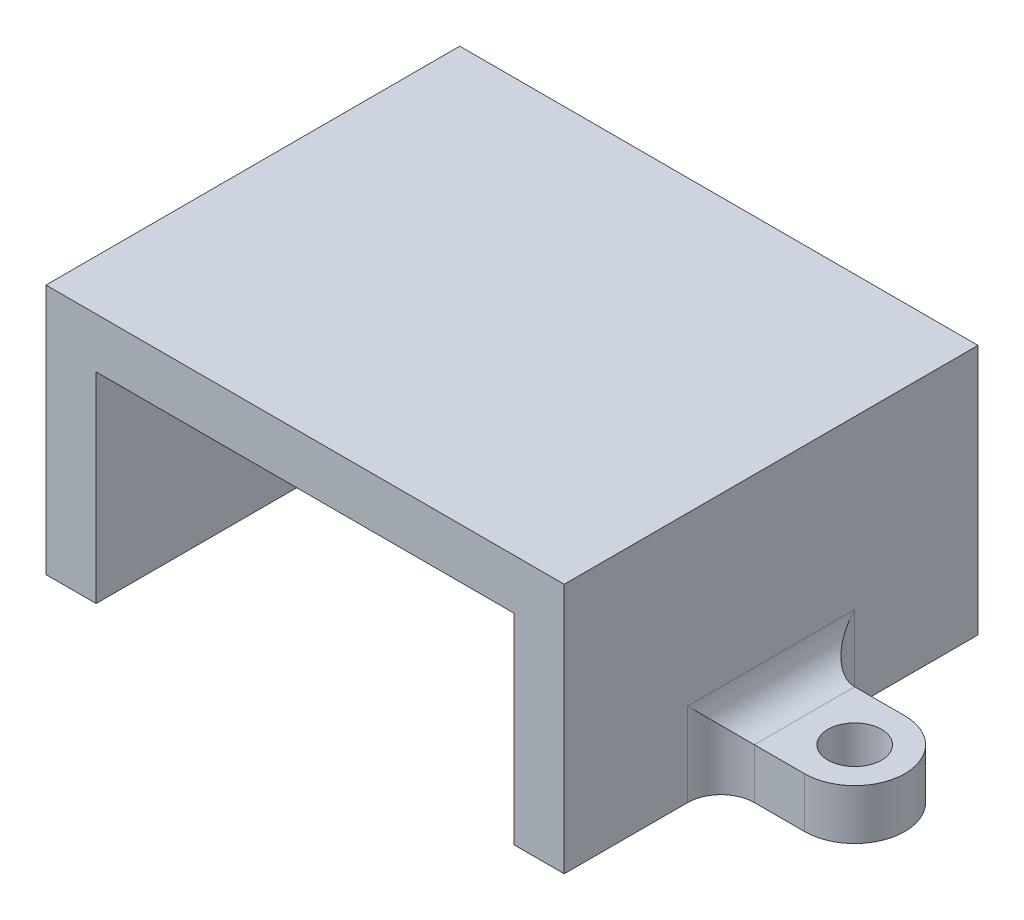
ISO-10303-21;
HEADER;
FILE_DESCRIPTION(('STEP AP214'),'2;1');
FILE_NAME('part.step','',(''),(''),'','','');
FILE_SCHEMA(('AUTOMOTIVE_DESIGN { 1 0 10303 214 1 1 1 1 }'));
ENDSEC;
DATA;
#1=APPLICATION_CONTEXT('core data for automotive mechanical design processes');
#2=APPLICATION_PROTOCOL_DEFINITION('international standard','automotive_design',2000,#1);
#3=PRODUCT_CONTEXT('',#1,'mechanical');
#4=PRODUCT('Part','Part','',(#3));
#5=PRODUCT_RELATED_PRODUCT_CATEGORY('part','',(#4));
#6=PRODUCT_DEFINITION_FORMATION('','',#4);
#7=PRODUCT_DEFINITION_CONTEXT('part definition',#1,'design');
#8=PRODUCT_DEFINITION('design','',#6,#7);
#9=PRODUCT_DEFINITION_SHAPE('','',#8);
#10=(LENGTH_UNIT() NAMED_UNIT(*) SI_UNIT(.MILLI.,.METRE.));
#11=(NAMED_UNIT(*) PLANE_ANGLE_UNIT() SI_UNIT($,.RADIAN.));
#12=(NAMED_UNIT(*) SI_UNIT($,.STERADIAN.) SOLID_ANGLE_UNIT());
#13=UNCERTAINTY_MEASURE_WITH_UNIT(LENGTH_MEASURE(1.E-05),#10,'distance_accuracy_value','');
#14=(GEOMETRIC_REPRESENTATION_CONTEXT(3) GLOBAL_UNCERTAINTY_ASSIGNED_CONTEXT((#13)) GLOBAL_UNIT_ASSIGNED_CONTEXT((#10,
#11,#12)) REPRESENTATION_CONTEXT('',''));
#15=CARTESIAN_POINT('',(0.,0.,0.));
#16=DIRECTION('',(0.,0.,1.));
#17=DIRECTION('',(1.,0.,0.));
#18=AXIS2_PLACEMENT_3D('',#15,#16,#17);
#19=CARTESIAN_POINT('',(31.,0.,24.75));
#20=DIRECTION('',(-1.,0.,0.));
#21=DIRECTION('',(0.,0.,1.));
#22=AXIS2_PLACEMENT_3D('',#19,#20,#21);
#23=PLANE('',#22);
#24=DIRECTION('',(0.,0.,-1.));
#25=VECTOR('',#24,1.);
#26=CARTESIAN_POINT('',(31.,5.,9.375));
#27=LINE('',#26,#25);
#28=CARTESIAN_POINT('',(31.,5.,17.375));
#29=VERTEX_POINT('',#28);
#30=CARTESIAN_POINT('',(31.,5.,7.375));
#31=VERTEX_POINT('',#30);
#32=EDGE_CURVE('E345',#29,#31,#27,.T.);
#33=ORIENTED_EDGE('',*,*,#32,.T.);
#34=DIRECTION('',(0.,-1.,0.));
#35=VECTOR('',#34,1.);
#36=CARTESIAN_POINT('',(31.,0.,7.375));
#37=LINE('',#36,#35);
#38=CARTESIAN_POINT('',(31.,0.,7.375));
#39=VERTEX_POINT('',#38);
#40=EDGE_CURVE('E351',#31,#39,#37,.T.);
#41=ORIENTED_EDGE('',*,*,#40,.T.);
#42=DIRECTION('',(0.,0.,-1.));
#43=VECTOR('',#42,1.);
#44=CARTESIAN_POINT('',(31.,0.,24.75));
#45=LINE('',#44,#43);
#46=CARTESIAN_POINT('',(31.,0.,0.));
#47=VERTEX_POINT('',#46);
#48=EDGE_CURVE('E320',#39,#47,#45,.T.);
#49=ORIENTED_EDGE('',*,*,#48,.T.);
#50=DIRECTION('',(0.,1.,0.));
#51=VECTOR('',#50,1.);
#52=CARTESIAN_POINT('',(31.,0.,0.));
#53=LINE('',#52,#51);
#54=CARTESIAN_POINT('',(31.,15.,0.));
#55=VERTEX_POINT('',#54);
#56=EDGE_CURVE('E308',#47,#55,#53,.T.);
#57=ORIENTED_EDGE('',*,*,#56,.T.);
#58=DIRECTION('',(0.,0.,-1.));
#59=VECTOR('',#58,1.);
#60=CARTESIAN_POINT('',(31.,15.,24.75));
#61=LINE('',#60,#59);
#62=CARTESIAN_POINT('',(31.,15.,24.75));
#63=VERTEX_POINT('',#62);
#64=EDGE_CURVE('E316',#63,#55,#61,.T.);
#65=ORIENTED_EDGE('',*,*,#64,.F.);
#66=DIRECTION('',(0.,1.,0.));
#67=VECTOR('',#66,1.);
#68=CARTESIAN_POINT('',(31.,0.,24.75));
#69=LINE('',#68,#67);
#70=CARTESIAN_POINT('',(31.,0.,24.75));
#71=VERTEX_POINT('',#70);
#72=EDGE_CURVE('E282',#71,#63,#69,.T.);
#73=ORIENTED_EDGE('',*,*,#72,.F.);
#74=CARTESIAN_POINT('',(31.,0.,17.375));
#75=VERTEX_POINT('',#74);
#76=EDGE_CURVE('E321',#71,#75,#45,.T.);
#77=ORIENTED_EDGE('',*,*,#76,.T.);
#78=DIRECTION('',(0.,-1.,0.));
#79=VECTOR('',#78,1.);
#80=CARTESIAN_POINT('',(31.,0.,17.375));
#81=LINE('',#80,#79);
#82=EDGE_CURVE('E348',#75,#29,#81,.F.);
#83=ORIENTED_EDGE('',*,*,#82,.T.);
#84=EDGE_LOOP('',(#33,#41,#49,#57,#65,#73,#77,#83));
#85=FACE_BOUND('',#84,.T.);
#86=ADVANCED_FACE('F39',(#85),#23,.F.);
#87=CARTESIAN_POINT('',(0.,15.,24.75));
#88=DIRECTION('',(1.,0.,0.));
#89=DIRECTION('',(0.,0.,-1.));
#90=AXIS2_PLACEMENT_3D('',#87,#88,#89);
#91=PLANE('',#90);
#92=DIRECTION('',(0.,0.,-1.));
#93=VECTOR('',#92,1.);
#94=CARTESIAN_POINT('',(0.,0.,24.75));
#95=LINE('',#94,#93);
#96=CARTESIAN_POINT('',(0.,0.,7.375));
#97=VERTEX_POINT('',#96);
#98=CARTESIAN_POINT('',(0.,0.,0.));
#99=VERTEX_POINT('',#98);
#100=EDGE_CURVE('E341',#97,#99,#95,.T.);
#101=ORIENTED_EDGE('',*,*,#100,.F.);
#102=DIRECTION('',(0.,-1.,0.));
#103=VECTOR('',#102,1.);
#104=CARTESIAN_POINT('',(0.,15.,7.375));
#105=LINE('',#104,#103);
#106=CARTESIAN_POINT('',(0.,5.,7.375));
#107=VERTEX_POINT('',#106);
#108=EDGE_CURVE('E387',#97,#107,#105,.F.);
#109=ORIENTED_EDGE('',*,*,#108,.T.);
#110=DIRECTION('',(0.,0.,1.));
#111=VECTOR('',#110,1.);
#112=CARTESIAN_POINT('',(0.,5.,24.75));
#113=LINE('',#112,#111);
#114=CARTESIAN_POINT('',(0.,5.,17.375));
#115=VERTEX_POINT('',#114);
#116=EDGE_CURVE('E384',#107,#115,#113,.T.);
#117=ORIENTED_EDGE('',*,*,#116,.T.);
#118=DIRECTION('',(0.,-1.,0.));
#119=VECTOR('',#118,1.);
#120=CARTESIAN_POINT('',(0.,15.,17.375));
#121=LINE('',#120,#119);
#122=CARTESIAN_POINT('',(0.,0.,17.375));
#123=VERTEX_POINT('',#122);
#124=EDGE_CURVE('E381',#115,#123,#121,.T.);
#125=ORIENTED_EDGE('',*,*,#124,.T.);
#126=CARTESIAN_POINT('',(0.,0.,24.75));
#127=VERTEX_POINT('',#126);
#128=EDGE_CURVE('E342',#127,#123,#95,.T.);
#129=ORIENTED_EDGE('',*,*,#128,.F.);
#130=DIRECTION('',(0.,-1.,0.));
#131=VECTOR('',#130,1.);
#132=CARTESIAN_POINT('',(0.,15.,24.75));
#133=LINE('',#132,#131);
#134=CARTESIAN_POINT('',(0.,15.,24.75));
#135=VERTEX_POINT('',#134);
#136=EDGE_CURVE('E262',#135,#127,#133,.T.);
#137=ORIENTED_EDGE('',*,*,#136,.F.);
#138=DIRECTION('',(0.,0.,-1.));
#139=VECTOR('',#138,1.);
#140=CARTESIAN_POINT('',(0.,15.,24.75));
#141=LINE('',#140,#139);
#142=CARTESIAN_POINT('',(0.,15.,0.));
#143=VERTEX_POINT('',#142);
#144=EDGE_CURVE('E288',#135,#143,#141,.T.);
#145=ORIENTED_EDGE('',*,*,#144,.T.);
#146=DIRECTION('',(0.,-1.,0.));
#147=VECTOR('',#146,1.);
#148=CARTESIAN_POINT('',(0.,15.,0.));
#149=LINE('',#148,#147);
#150=EDGE_CURVE('E258',#143,#99,#149,.T.);
#151=ORIENTED_EDGE('',*,*,#150,.T.);
#152=EDGE_LOOP('',(#101,#109,#117,#125,#129,#137,#145,#151));
#153=FACE_BOUND('',#152,.T.);
#154=ADVANCED_FACE('F415',(#153),#91,.F.);
#155=CARTESIAN_POINT('',(0.,0.,24.75));
#156=DIRECTION('',(0.,1.,0.));
#157=DIRECTION('',(0.,0.,1.));
#158=AXIS2_PLACEMENT_3D('',#155,#156,#157);
#159=PLANE('',#158);
#160=DIRECTION('',(1.,0.,0.));
#161=VECTOR('',#160,1.);
#162=CARTESIAN_POINT('',(0.,0.,0.));
#163=LINE('',#162,#161);
#164=CARTESIAN_POINT('',(3.,0.,0.));
#165=VERTEX_POINT('',#164);
#166=EDGE_CURVE('E292',#99,#165,#163,.T.);
#167=ORIENTED_EDGE('',*,*,#166,.T.);
#168=DIRECTION('',(0.,0.,-1.));
#169=VECTOR('',#168,1.);
#170=CARTESIAN_POINT('',(3.,0.,24.75));
#171=LINE('',#170,#169);
#172=CARTESIAN_POINT('',(3.,0.,24.75));
#173=VERTEX_POINT('',#172);
#174=EDGE_CURVE('E337',#173,#165,#171,.T.);
#175=ORIENTED_EDGE('',*,*,#174,.F.);
#176=DIRECTION('',(1.,0.,0.));
#177=VECTOR('',#176,1.);
#178=CARTESIAN_POINT('',(0.,0.,24.75));
#179=LINE('',#178,#177);
#180=EDGE_CURVE('E266',#127,#173,#179,.T.);
#181=ORIENTED_EDGE('',*,*,#180,.F.);
#182=ORIENTED_EDGE('',*,*,#128,.T.);
#183=CARTESIAN_POINT('',(-2.,0.,17.375));
#184=DIRECTION('',(0.,1.,0.));
#185=DIRECTION('',(0.,0.,1.));
#186=AXIS2_PLACEMENT_3D('',#183,#184,#185);
#187=CIRCLE('',#186,2.);
#188=CARTESIAN_POINT('',(-2.,0.,15.375));
#189=VERTEX_POINT('',#188);
#190=EDGE_CURVE('E11',#123,#189,#187,.T.);
#191=ORIENTED_EDGE('',*,*,#190,.T.);
#192=DIRECTION('',(-1.,0.,0.));
#193=VECTOR('',#192,1.);
#194=CARTESIAN_POINT('',(0.,0.,15.375));
#195=LINE('',#194,#193);
#196=CARTESIAN_POINT('',(-5.,0.,15.375));
#197=VERTEX_POINT('',#196);
#198=EDGE_CURVE('E229',#189,#197,#195,.T.);
#199=ORIENTED_EDGE('',*,*,#198,.T.);
#200=CARTESIAN_POINT('',(-5.,0.,12.375));
#201=DIRECTION('',(0.,-1.,0.));
#202=DIRECTION('',(0.,0.,1.));
#203=AXIS2_PLACEMENT_3D('',#200,#201,#202);
#204=CIRCLE('',#203,3.);
#205=CARTESIAN_POINT('',(-4.99999999999999,0.,9.375));
#206=VERTEX_POINT('',#205);
#207=EDGE_CURVE('E248',#197,#206,#204,.T.);
#208=ORIENTED_EDGE('',*,*,#207,.T.);
#209=DIRECTION('',(1.,0.,0.));
#210=VECTOR('',#209,1.);
#211=CARTESIAN_POINT('',(-4.99999999999999,0.,9.375));
#212=LINE('',#211,#210);
#213=CARTESIAN_POINT('',(-2.,0.,9.375));
#214=VERTEX_POINT('',#213);
#215=EDGE_CURVE('E237',#206,#214,#212,.T.);
#216=ORIENTED_EDGE('',*,*,#215,.T.);
#217=CARTESIAN_POINT('',(-2.,0.,7.375));
#218=DIRECTION('',(0.,1.,0.));
#219=DIRECTION('',(0.,0.,1.));
#220=AXIS2_PLACEMENT_3D('',#217,#218,#219);
#221=CIRCLE('',#220,2.);
#222=EDGE_CURVE('E49',#214,#97,#221,.T.);
#223=ORIENTED_EDGE('',*,*,#222,.T.);
#224=ORIENTED_EDGE('',*,*,#100,.T.);
#225=EDGE_LOOP('',(#167,#175,#181,#182,#191,#199,#208,#216,#223,#224));
#226=FACE_BOUND('',#225,.T.);
#227=CARTESIAN_POINT('',(-5.,0.,12.375));
#228=DIRECTION('',(0.,-1.,0.));
#229=DIRECTION('',(0.,0.,1.));
#230=AXIS2_PLACEMENT_3D('',#227,#228,#229);
#231=CIRCLE('',#230,1.6);
#232=CARTESIAN_POINT('',(-5.,0.,13.975));
#233=VERTEX_POINT('',#232);
#234=EDGE_CURVE('E223',#233,#233,#231,.T.);
#235=ORIENTED_EDGE('',*,*,#234,.F.);
#236=EDGE_LOOP('',(#235));
#237=FACE_BOUND('',#236,.T.);
#238=ADVANCED_FACE('F417',(#226,#237),#159,.F.);
#239=CARTESIAN_POINT('',(3.,0.,24.75));
#240=DIRECTION('',(-1.,0.,0.));
#241=DIRECTION('',(0.,-1.,0.));
#242=AXIS2_PLACEMENT_3D('',#239,#240,#241);
#243=PLANE('',#242);
#244=DIRECTION('',(0.,1.,0.));
#245=VECTOR('',#244,1.);
#246=CARTESIAN_POINT('',(3.,0.,0.));
#247=LINE('',#246,#245);
#248=CARTESIAN_POINT('',(3.,12.,0.));
#249=VERTEX_POINT('',#248);
#250=EDGE_CURVE('E295',#165,#249,#247,.T.);
#251=ORIENTED_EDGE('',*,*,#250,.T.);
#252=DIRECTION('',(0.,0.,-1.));
#253=VECTOR('',#252,1.);
#254=CARTESIAN_POINT('',(3.,12.,24.75));
#255=LINE('',#254,#253);
#256=CARTESIAN_POINT('',(3.,12.,24.75));
#257=VERTEX_POINT('',#256);
#258=EDGE_CURVE('E333',#257,#249,#255,.T.);
#259=ORIENTED_EDGE('',*,*,#258,.F.);
#260=DIRECTION('',(0.,1.,0.));
#261=VECTOR('',#260,1.);
#262=CARTESIAN_POINT('',(3.,0.,24.75));
#263=LINE('',#262,#261);
#264=EDGE_CURVE('E270',#173,#257,#263,.T.);
#265=ORIENTED_EDGE('',*,*,#264,.F.);
#266=ORIENTED_EDGE('',*,*,#174,.T.);
#267=EDGE_LOOP('',(#251,#259,#265,#266));
#268=FACE_BOUND('',#267,.T.);
#269=ADVANCED_FACE('F435',(#268),#243,.F.);
#270=CARTESIAN_POINT('',(3.,12.,24.75));
#271=DIRECTION('',(0.,1.,0.));
#272=DIRECTION('',(0.,0.,1.));
#273=AXIS2_PLACEMENT_3D('',#270,#271,#272);
#274=PLANE('',#273);
#275=DIRECTION('',(1.,0.,0.));
#276=VECTOR('',#275,1.);
#277=CARTESIAN_POINT('',(3.,12.,0.));
#278=LINE('',#277,#276);
#279=CARTESIAN_POINT('',(28.,12.,0.));
#280=VERTEX_POINT('',#279);
#281=EDGE_CURVE('E298',#249,#280,#278,.T.);
#282=ORIENTED_EDGE('',*,*,#281,.T.);
#283=DIRECTION('',(0.,0.,-1.));
#284=VECTOR('',#283,1.);
#285=CARTESIAN_POINT('',(28.,12.,24.75));
#286=LINE('',#285,#284);
#287=CARTESIAN_POINT('',(28.,12.,24.75));
#288=VERTEX_POINT('',#287);
#289=EDGE_CURVE('E329',#288,#280,#286,.T.);
#290=ORIENTED_EDGE('',*,*,#289,.F.);
#291=DIRECTION('',(1.,0.,0.));
#292=VECTOR('',#291,1.);
#293=CARTESIAN_POINT('',(3.,12.,24.75));
#294=LINE('',#293,#292);
#295=EDGE_CURVE('E273',#257,#288,#294,.T.);
#296=ORIENTED_EDGE('',*,*,#295,.F.);
#297=ORIENTED_EDGE('',*,*,#258,.T.);
#298=EDGE_LOOP('',(#282,#290,#296,#297));
#299=FACE_BOUND('',#298,.T.);
#300=ADVANCED_FACE('F442',(#299),#274,.F.);
#301=CARTESIAN_POINT('',(28.,12.,24.75));
#302=DIRECTION('',(1.,0.,0.));
#303=DIRECTION('',(0.,0.,-1.));
#304=AXIS2_PLACEMENT_3D('',#301,#302,#303);
#305=PLANE('',#304);
#306=DIRECTION('',(0.,-1.,0.));
#307=VECTOR('',#306,1.);
#308=CARTESIAN_POINT('',(28.,12.,0.));
#309=LINE('',#308,#307);
#310=CARTESIAN_POINT('',(28.,0.,0.));
#311=VERTEX_POINT('',#310);
#312=EDGE_CURVE('E301',#280,#311,#309,.T.);
#313=ORIENTED_EDGE('',*,*,#312,.T.);
#314=DIRECTION('',(0.,0.,-1.));
#315=VECTOR('',#314,1.);
#316=CARTESIAN_POINT('',(28.,0.,24.75));
#317=LINE('',#316,#315);
#318=CARTESIAN_POINT('',(28.,0.,24.75));
#319=VERTEX_POINT('',#318);
#320=EDGE_CURVE('E325',#319,#311,#317,.T.);
#321=ORIENTED_EDGE('',*,*,#320,.F.);
#322=DIRECTION('',(0.,-1.,0.));
#323=VECTOR('',#322,1.);
#324=CARTESIAN_POINT('',(28.,12.,24.75));
#325=LINE('',#324,#323);
#326=EDGE_CURVE('E276',#288,#319,#325,.T.);
#327=ORIENTED_EDGE('',*,*,#326,.F.);
#328=ORIENTED_EDGE('',*,*,#289,.T.);
#329=EDGE_LOOP('',(#313,#321,#327,#328));
#330=FACE_BOUND('',#329,.T.);
#331=ADVANCED_FACE('F445',(#330),#305,.F.);
#332=CARTESIAN_POINT('',(28.,0.,24.75));
#333=DIRECTION('',(0.,1.,0.));
#334=DIRECTION('',(0.,0.,1.));
#335=AXIS2_PLACEMENT_3D('',#332,#333,#334);
#336=PLANE('',#335);
#337=DIRECTION('',(1.,0.,0.));
#338=VECTOR('',#337,1.);
#339=CARTESIAN_POINT('',(28.,0.,0.));
#340=LINE('',#339,#338);
#341=EDGE_CURVE('E304',#311,#47,#340,.T.);
#342=ORIENTED_EDGE('',*,*,#341,.T.);
#343=ORIENTED_EDGE('',*,*,#48,.F.);
#344=CARTESIAN_POINT('',(33.,0.,7.375));
#345=DIRECTION('',(0.,1.,0.));
#346=DIRECTION('',(0.,0.,1.));
#347=AXIS2_PLACEMENT_3D('',#344,#345,#346);
#348=CIRCLE('',#347,2.);
#349=CARTESIAN_POINT('',(33.,0.,9.375));
#350=VERTEX_POINT('',#349);
#351=EDGE_CURVE('E363',#39,#350,#348,.T.);
#352=ORIENTED_EDGE('',*,*,#351,.T.);
#353=DIRECTION('',(1.,0.,0.));
#354=VECTOR('',#353,1.);
#355=CARTESIAN_POINT('',(36.,0.,9.375));
#356=LINE('',#355,#354);
#357=CARTESIAN_POINT('',(36.,0.,9.375));
#358=VERTEX_POINT('',#357);
#359=EDGE_CURVE('E206',#350,#358,#356,.T.);
#360=ORIENTED_EDGE('',*,*,#359,.T.);
#361=CARTESIAN_POINT('',(36.,0.,12.375));
#362=DIRECTION('',(0.,-1.,0.));
#363=DIRECTION('',(0.,0.,-1.));
#364=AXIS2_PLACEMENT_3D('',#361,#362,#363);
#365=CIRCLE('',#364,3.);
#366=CARTESIAN_POINT('',(36.,0.,15.375));
#367=VERTEX_POINT('',#366);
#368=EDGE_CURVE('E216',#358,#367,#365,.T.);
#369=ORIENTED_EDGE('',*,*,#368,.T.);
#370=DIRECTION('',(-1.,0.,0.));
#371=VECTOR('',#370,1.);
#372=CARTESIAN_POINT('',(31.,0.,15.375));
#373=LINE('',#372,#371);
#374=CARTESIAN_POINT('',(33.,0.,15.375));
#375=VERTEX_POINT('',#374);
#376=EDGE_CURVE('E184',#367,#375,#373,.T.);
#377=ORIENTED_EDGE('',*,*,#376,.T.);
#378=CARTESIAN_POINT('',(33.,0.,17.375));
#379=DIRECTION('',(0.,1.,0.));
#380=DIRECTION('',(0.,0.,1.));
#381=AXIS2_PLACEMENT_3D('',#378,#379,#380);
#382=CIRCLE('',#381,2.);
#383=EDGE_CURVE('E366',#375,#75,#382,.T.);
#384=ORIENTED_EDGE('',*,*,#383,.T.);
#385=ORIENTED_EDGE('',*,*,#76,.F.);
#386=DIRECTION('',(1.,0.,0.));
#387=VECTOR('',#386,1.);
#388=CARTESIAN_POINT('',(28.,0.,24.75));
#389=LINE('',#388,#387);
#390=EDGE_CURVE('E279',#319,#71,#389,.T.);
#391=ORIENTED_EDGE('',*,*,#390,.F.);
#392=ORIENTED_EDGE('',*,*,#320,.T.);
#393=EDGE_LOOP('',(#342,#343,#352,#360,#369,#377,#384,#385,#391,#392));
#394=FACE_BOUND('',#393,.T.);
#395=CARTESIAN_POINT('',(36.,0.,12.375));
#396=DIRECTION('',(0.,-1.,0.));
#397=DIRECTION('',(0.,0.,-1.));
#398=AXIS2_PLACEMENT_3D('',#395,#396,#397);
#399=CIRCLE('',#398,1.6);
#400=CARTESIAN_POINT('',(36.,0.,10.775));
#401=VERTEX_POINT('',#400);
#402=EDGE_CURVE('E211',#401,#401,#399,.T.);
#403=ORIENTED_EDGE('',*,*,#402,.F.);
#404=EDGE_LOOP('',(#403));
#405=FACE_BOUND('',#404,.T.);
#406=ADVANCED_FACE('F450',(#394,#405),#336,.F.);
#407=CARTESIAN_POINT('',(31.,15.,24.75));
#408=DIRECTION('',(0.,-1.,0.));
#409=DIRECTION('',(1.,0.,0.));
#410=AXIS2_PLACEMENT_3D('',#407,#408,#409);
#411=PLANE('',#410);
#412=DIRECTION('',(-1.,0.,0.));
#413=VECTOR('',#412,1.);
#414=CARTESIAN_POINT('',(31.,15.,0.));
#415=LINE('',#414,#413);
#416=EDGE_CURVE('E267',#55,#143,#415,.T.);
#417=ORIENTED_EDGE('',*,*,#416,.T.);
#418=ORIENTED_EDGE('',*,*,#144,.F.);
#419=DIRECTION('',(-1.,0.,0.));
#420=VECTOR('',#419,1.);
#421=CARTESIAN_POINT('',(31.,15.,24.75));
#422=LINE('',#421,#420);
#423=EDGE_CURVE('E285',#63,#135,#422,.T.);
#424=ORIENTED_EDGE('',*,*,#423,.F.);
#425=ORIENTED_EDGE('',*,*,#64,.T.);
#426=EDGE_LOOP('',(#417,#418,#424,#425));
#427=FACE_BOUND('',#426,.T.);
#428=ADVANCED_FACE('F455',(#427),#411,.F.);
#429=CARTESIAN_POINT('',(0.,0.,24.75));
#430=DIRECTION('',(0.,0.,1.));
#431=DIRECTION('',(1.,0.,0.));
#432=AXIS2_PLACEMENT_3D('',#429,#430,#431);
#433=PLANE('',#432);
#434=ORIENTED_EDGE('',*,*,#136,.T.);
#435=ORIENTED_EDGE('',*,*,#180,.T.);
#436=ORIENTED_EDGE('',*,*,#264,.T.);
#437=ORIENTED_EDGE('',*,*,#295,.T.);
#438=ORIENTED_EDGE('',*,*,#326,.T.);
#439=ORIENTED_EDGE('',*,*,#390,.T.);
#440=ORIENTED_EDGE('',*,*,#72,.T.);
#441=ORIENTED_EDGE('',*,*,#423,.T.);
#442=EDGE_LOOP('',(#434,#435,#436,#437,#438,#439,#440,#441));
#443=FACE_BOUND('',#442,.T.);
#444=ADVANCED_FACE('F422',(#443),#433,.T.);
#445=CARTESIAN_POINT('',(0.,0.,0.));
#446=DIRECTION('',(0.,0.,1.));
#447=DIRECTION('',(1.,0.,0.));
#448=AXIS2_PLACEMENT_3D('',#445,#446,#447);
#449=PLANE('',#448);
#450=ORIENTED_EDGE('',*,*,#150,.F.);
#451=ORIENTED_EDGE('',*,*,#416,.F.);
#452=ORIENTED_EDGE('',*,*,#56,.F.);
#453=ORIENTED_EDGE('',*,*,#341,.F.);
#454=ORIENTED_EDGE('',*,*,#312,.F.);
#455=ORIENTED_EDGE('',*,*,#281,.F.);
#456=ORIENTED_EDGE('',*,*,#250,.F.);
#457=ORIENTED_EDGE('',*,*,#166,.F.);
#458=EDGE_LOOP('',(#450,#451,#452,#453,#454,#455,#456,#457));
#459=FACE_BOUND('',#458,.T.);
#460=ADVANCED_FACE('F430',(#459),#449,.F.);
#461=CARTESIAN_POINT('',(0.,3.,15.375));
#462=DIRECTION('',(0.,0.,1.));
#463=DIRECTION('',(1.,0.,0.));
#464=AXIS2_PLACEMENT_3D('',#461,#462,#463);
#465=PLANE('',#464);
#466=ORIENTED_EDGE('',*,*,#198,.F.);
#467=DIRECTION('',(0.,-1.,0.));
#468=VECTOR('',#467,1.);
#469=CARTESIAN_POINT('',(-2.,3.,15.375));
#470=LINE('',#469,#468);
#471=CARTESIAN_POINT('',(-2.,3.,15.375));
#472=VERTEX_POINT('',#471);
#473=EDGE_CURVE('E62',#189,#472,#470,.F.);
#474=ORIENTED_EDGE('',*,*,#473,.T.);
#475=DIRECTION('',(-1.,0.,0.));
#476=VECTOR('',#475,1.);
#477=CARTESIAN_POINT('',(0.,3.,15.375));
#478=LINE('',#477,#476);
#479=CARTESIAN_POINT('',(-5.,3.,15.375));
#480=VERTEX_POINT('',#479);
#481=EDGE_CURVE('E233',#472,#480,#478,.T.);
#482=ORIENTED_EDGE('',*,*,#481,.T.);
#483=DIRECTION('',(0.,-1.,0.));
#484=VECTOR('',#483,1.);
#485=CARTESIAN_POINT('',(-5.,3.,15.375));
#486=LINE('',#485,#484);
#487=EDGE_CURVE('E245',#480,#197,#486,.T.);
#488=ORIENTED_EDGE('',*,*,#487,.T.);
#489=EDGE_LOOP('',(#466,#474,#482,#488));
#490=FACE_BOUND('',#489,.T.);
#491=ADVANCED_FACE('F581',(#490),#465,.T.);
#492=CARTESIAN_POINT('',(-4.99999999999999,3.,9.375));
#493=DIRECTION('',(0.,0.,-1.));
#494=DIRECTION('',(-1.,0.,0.));
#495=AXIS2_PLACEMENT_3D('',#492,#493,#494);
#496=PLANE('',#495);
#497=DIRECTION('',(1.,0.,0.));
#498=VECTOR('',#497,1.);
#499=CARTESIAN_POINT('',(-4.99999999999999,3.,9.375));
#500=LINE('',#499,#498);
#501=CARTESIAN_POINT('',(-4.99999999999999,3.,9.375));
#502=VERTEX_POINT('',#501);
#503=CARTESIAN_POINT('',(-2.,3.,9.375));
#504=VERTEX_POINT('',#503);
#505=EDGE_CURVE('E241',#502,#504,#500,.T.);
#506=ORIENTED_EDGE('',*,*,#505,.T.);
#507=DIRECTION('',(0.,-1.,0.));
#508=VECTOR('',#507,1.);
#509=CARTESIAN_POINT('',(-2.,3.,9.375));
#510=LINE('',#509,#508);
#511=EDGE_CURVE('E369',#504,#214,#510,.T.);
#512=ORIENTED_EDGE('',*,*,#511,.T.);
#513=ORIENTED_EDGE('',*,*,#215,.F.);
#514=DIRECTION('',(0.,-1.,0.));
#515=VECTOR('',#514,1.);
#516=CARTESIAN_POINT('',(-4.99999999999999,3.,9.375));
#517=LINE('',#516,#515);
#518=EDGE_CURVE('E255',#502,#206,#517,.T.);
#519=ORIENTED_EDGE('',*,*,#518,.F.);
#520=EDGE_LOOP('',(#506,#512,#513,#519));
#521=FACE_BOUND('',#520,.T.);
#522=ADVANCED_FACE('F573',(#521),#496,.T.);
#523=CARTESIAN_POINT('',(-5.,3.,12.375));
#524=DIRECTION('',(0.,-1.,0.));
#525=DIRECTION('',(0.,0.,-1.));
#526=AXIS2_PLACEMENT_3D('',#523,#524,#525);
#527=CYLINDRICAL_SURFACE('',#526,3.);
#528=ORIENTED_EDGE('',*,*,#207,.F.);
#529=ORIENTED_EDGE('',*,*,#487,.F.);
#530=CARTESIAN_POINT('',(-5.,3.,12.375));
#531=DIRECTION('',(0.,-1.,0.));
#532=DIRECTION('',(0.,0.,1.));
#533=AXIS2_PLACEMENT_3D('',#530,#531,#532);
#534=CIRCLE('',#533,3.);
#535=EDGE_CURVE('E236',#480,#502,#534,.T.);
#536=ORIENTED_EDGE('',*,*,#535,.T.);
#537=ORIENTED_EDGE('',*,*,#518,.T.);
#538=EDGE_LOOP('',(#528,#529,#536,#537));
#539=FACE_BOUND('',#538,.T.);
#540=ADVANCED_FACE('F565',(#539),#527,.T.);
#541=CARTESIAN_POINT('',(-5.,3.,12.375));
#542=DIRECTION('',(0.,1.,0.));
#543=DIRECTION('',(0.,0.,1.));
#544=AXIS2_PLACEMENT_3D('',#541,#542,#543);
#545=PLANE('',#544);
#546=CARTESIAN_POINT('',(-5.,3.,12.375));
#547=DIRECTION('',(0.,-1.,0.));
#548=DIRECTION('',(0.,0.,1.));
#549=AXIS2_PLACEMENT_3D('',#546,#547,#548);
#550=CIRCLE('',#549,1.6);
#551=CARTESIAN_POINT('',(-5.,3.,13.975));
#552=VERTEX_POINT('',#551);
#553=EDGE_CURVE('E225',#552,#552,#550,.T.);
#554=ORIENTED_EDGE('',*,*,#553,.T.);
#555=EDGE_LOOP('',(#554));
#556=FACE_BOUND('',#555,.T.);
#557=ORIENTED_EDGE('',*,*,#481,.F.);
#558=DIRECTION('',(0.,0.,1.));
#559=VECTOR('',#558,1.);
#560=CARTESIAN_POINT('',(-2.,3.,12.375));
#561=LINE('',#560,#559);
#562=EDGE_CURVE('E390',#472,#504,#561,.F.);
#563=ORIENTED_EDGE('',*,*,#562,.T.);
#564=ORIENTED_EDGE('',*,*,#505,.F.);
#565=ORIENTED_EDGE('',*,*,#535,.F.);
#566=EDGE_LOOP('',(#557,#563,#564,#565));
#567=FACE_BOUND('',#566,.T.);
#568=ADVANCED_FACE('F557',(#556,#567),#545,.T.);
#569=CARTESIAN_POINT('',(-5.,3.,12.375));
#570=DIRECTION('',(0.,-1.,0.));
#571=DIRECTION('',(0.,0.,-1.));
#572=AXIS2_PLACEMENT_3D('',#569,#570,#571);
#573=CYLINDRICAL_SURFACE('',#572,1.6);
#574=ORIENTED_EDGE('',*,*,#553,.F.);
#575=EDGE_LOOP('',(#574));
#576=FACE_BOUND('',#575,.T.);
#577=ORIENTED_EDGE('',*,*,#234,.T.);
#578=EDGE_LOOP('',(#577));
#579=FACE_BOUND('',#578,.T.);
#580=ADVANCED_FACE('F550',(#576,#579),#573,.F.);
#581=CARTESIAN_POINT('',(36.,3.,12.375));
#582=DIRECTION('',(0.,-1.,0.));
#583=DIRECTION('',(0.,0.,-1.));
#584=AXIS2_PLACEMENT_3D('',#581,#582,#583);
#585=CYLINDRICAL_SURFACE('',#584,3.);
#586=ORIENTED_EDGE('',*,*,#368,.F.);
#587=DIRECTION('',(0.,-1.,0.));
#588=VECTOR('',#587,1.);
#589=CARTESIAN_POINT('',(36.,3.,9.375));
#590=LINE('',#589,#588);
#591=CARTESIAN_POINT('',(36.,3.,9.375));
#592=VERTEX_POINT('',#591);
#593=EDGE_CURVE('E190',#592,#358,#590,.T.);
#594=ORIENTED_EDGE('',*,*,#593,.F.);
#595=CARTESIAN_POINT('',(36.,3.,12.375));
#596=DIRECTION('',(0.,-1.,0.));
#597=DIRECTION('',(0.,0.,-1.));
#598=AXIS2_PLACEMENT_3D('',#595,#596,#597);
#599=CIRCLE('',#598,3.);
#600=CARTESIAN_POINT('',(36.,3.,15.375));
#601=VERTEX_POINT('',#600);
#602=EDGE_CURVE('E197',#592,#601,#599,.T.);
#603=ORIENTED_EDGE('',*,*,#602,.T.);
#604=DIRECTION('',(0.,-1.,0.));
#605=VECTOR('',#604,1.);
#606=CARTESIAN_POINT('',(36.,3.,15.375));
#607=LINE('',#606,#605);
#608=EDGE_CURVE('E178',#601,#367,#607,.T.);
#609=ORIENTED_EDGE('',*,*,#608,.T.);
#610=EDGE_LOOP('',(#586,#594,#603,#609));
#611=FACE_BOUND('',#610,.T.);
#612=ADVANCED_FACE('F203',(#611),#585,.T.);
#613=CARTESIAN_POINT('',(36.,3.,9.375));
#614=DIRECTION('',(0.,0.,-1.));
#615=DIRECTION('',(-1.,0.,0.));
#616=AXIS2_PLACEMENT_3D('',#613,#614,#615);
#617=PLANE('',#616);
#618=ORIENTED_EDGE('',*,*,#359,.F.);
#619=DIRECTION('',(0.,-1.,0.));
#620=VECTOR('',#619,1.);
#621=CARTESIAN_POINT('',(33.,3.,9.375));
#622=LINE('',#621,#620);
#623=CARTESIAN_POINT('',(33.,3.,9.375));
#624=VERTEX_POINT('',#623);
#625=EDGE_CURVE('E355',#350,#624,#622,.F.);
#626=ORIENTED_EDGE('',*,*,#625,.T.);
#627=DIRECTION('',(1.,0.,0.));
#628=VECTOR('',#627,1.);
#629=CARTESIAN_POINT('',(36.,3.,9.375));
#630=LINE('',#629,#628);
#631=EDGE_CURVE('E191',#624,#592,#630,.T.);
#632=ORIENTED_EDGE('',*,*,#631,.T.);
#633=ORIENTED_EDGE('',*,*,#593,.T.);
#634=EDGE_LOOP('',(#618,#626,#632,#633));
#635=FACE_BOUND('',#634,.T.);
#636=ADVANCED_FACE('F536',(#635),#617,.T.);
#637=CARTESIAN_POINT('',(31.,3.,15.375));
#638=DIRECTION('',(0.,0.,1.));
#639=DIRECTION('',(1.,0.,0.));
#640=AXIS2_PLACEMENT_3D('',#637,#638,#639);
#641=PLANE('',#640);
#642=DIRECTION('',(-1.,0.,0.));
#643=VECTOR('',#642,1.);
#644=CARTESIAN_POINT('',(31.,3.,15.375));
#645=LINE('',#644,#643);
#646=CARTESIAN_POINT('',(33.,3.,15.375));
#647=VERTEX_POINT('',#646);
#648=EDGE_CURVE('E181',#601,#647,#645,.T.);
#649=ORIENTED_EDGE('',*,*,#648,.T.);
#650=DIRECTION('',(0.,-1.,0.));
#651=VECTOR('',#650,1.);
#652=CARTESIAN_POINT('',(33.,3.,15.375));
#653=LINE('',#652,#651);
#654=EDGE_CURVE('E358',#647,#375,#653,.T.);
#655=ORIENTED_EDGE('',*,*,#654,.T.);
#656=ORIENTED_EDGE('',*,*,#376,.F.);
#657=ORIENTED_EDGE('',*,*,#608,.F.);
#658=EDGE_LOOP('',(#649,#655,#656,#657));
#659=FACE_BOUND('',#658,.T.);
#660=ADVANCED_FACE('F180',(#659),#641,.T.);
#661=CARTESIAN_POINT('',(36.,3.,12.375));
#662=DIRECTION('',(0.,-1.,0.));
#663=DIRECTION('',(0.,0.,-1.));
#664=AXIS2_PLACEMENT_3D('',#661,#662,#663);
#665=PLANE('',#664);
#666=CARTESIAN_POINT('',(36.,3.,12.375));
#667=DIRECTION('',(0.,-1.,0.));
#668=DIRECTION('',(0.,0.,-1.));
#669=AXIS2_PLACEMENT_3D('',#666,#667,#668);
#670=CIRCLE('',#669,1.6);
#671=CARTESIAN_POINT('',(36.,3.,10.775));
#672=VERTEX_POINT('',#671);
#673=EDGE_CURVE('E219',#672,#672,#670,.T.);
#674=ORIENTED_EDGE('',*,*,#673,.T.);
#675=EDGE_LOOP('',(#674));
#676=FACE_BOUND('',#675,.T.);
#677=ORIENTED_EDGE('',*,*,#631,.F.);
#678=DIRECTION('',(0.,0.,-1.));
#679=VECTOR('',#678,1.);
#680=CARTESIAN_POINT('',(33.,3.,15.375));
#681=LINE('',#680,#679);
#682=EDGE_CURVE('E199',#624,#647,#681,.F.);
#683=ORIENTED_EDGE('',*,*,#682,.T.);
#684=ORIENTED_EDGE('',*,*,#648,.F.);
#685=ORIENTED_EDGE('',*,*,#602,.F.);
#686=EDGE_LOOP('',(#677,#683,#684,#685));
#687=FACE_BOUND('',#686,.T.);
#688=ADVANCED_FACE('F196',(#676,#687),#665,.F.);
#689=CARTESIAN_POINT('',(36.,3.,12.375));
#690=DIRECTION('',(0.,-1.,0.));
#691=DIRECTION('',(0.,0.,-1.));
#692=AXIS2_PLACEMENT_3D('',#689,#690,#691);
#693=CYLINDRICAL_SURFACE('',#692,1.6);
#694=ORIENTED_EDGE('',*,*,#673,.F.);
#695=EDGE_LOOP('',(#694));
#696=FACE_BOUND('',#695,.T.);
#697=ORIENTED_EDGE('',*,*,#402,.T.);
#698=EDGE_LOOP('',(#697));
#699=FACE_BOUND('',#698,.T.);
#700=ADVANCED_FACE('F491',(#696,#699),#693,.F.);
#701=CARTESIAN_POINT('',(33.,3.,17.375));
#702=DIRECTION('',(0.,-1.,0.));
#703=DIRECTION('',(0.,0.,-1.));
#704=AXIS2_PLACEMENT_3D('',#701,#702,#703);
#705=CYLINDRICAL_SURFACE('',#704,2.);
#706=ORIENTED_EDGE('',*,*,#383,.F.);
#707=ORIENTED_EDGE('',*,*,#654,.F.);
#708=CARTESIAN_POINT('',(33.,5.,17.375));
#709=DIRECTION('',(0.,-0.707106781186547,0.707106781186547));
#710=DIRECTION('',(0.,0.707106781186547,0.707106781186547));
#711=AXIS2_PLACEMENT_3D('',#708,#709,#710);
#712=ELLIPSE('',#711,2.82842712474619,2.);
#713=EDGE_CURVE('E374',#29,#647,#712,.T.);
#714=ORIENTED_EDGE('',*,*,#713,.F.);
#715=ORIENTED_EDGE('',*,*,#82,.F.);
#716=EDGE_LOOP('',(#706,#707,#714,#715));
#717=FACE_BOUND('',#716,.T.);
#718=ADVANCED_FACE('F487',(#717),#705,.F.);
#719=CARTESIAN_POINT('',(33.,5.,24.75));
#720=DIRECTION('',(0.,0.,1.));
#721=DIRECTION('',(1.,0.,0.));
#722=AXIS2_PLACEMENT_3D('',#719,#720,#721);
#723=CYLINDRICAL_SURFACE('',#722,2.);
#724=ORIENTED_EDGE('',*,*,#713,.T.);
#725=ORIENTED_EDGE('',*,*,#682,.F.);
#726=CARTESIAN_POINT('',(33.,5.,7.375));
#727=DIRECTION('',(0.,0.707106781186547,0.707106781186547));
#728=DIRECTION('',(0.,-0.707106781186547,0.707106781186547));
#729=AXIS2_PLACEMENT_3D('',#726,#727,#728);
#730=ELLIPSE('',#729,2.82842712474619,2.);
#731=EDGE_CURVE('E370',#31,#624,#730,.T.);
#732=ORIENTED_EDGE('',*,*,#731,.F.);
#733=ORIENTED_EDGE('',*,*,#32,.F.);
#734=EDGE_LOOP('',(#724,#725,#732,#733));
#735=FACE_BOUND('',#734,.T.);
#736=ADVANCED_FACE('F483',(#735),#723,.F.);
#737=CARTESIAN_POINT('',(33.,0.,7.375));
#738=DIRECTION('',(0.,-1.,0.));
#739=DIRECTION('',(0.,0.,-1.));
#740=AXIS2_PLACEMENT_3D('',#737,#738,#739);
#741=CYLINDRICAL_SURFACE('',#740,2.);
#742=ORIENTED_EDGE('',*,*,#731,.T.);
#743=ORIENTED_EDGE('',*,*,#625,.F.);
#744=ORIENTED_EDGE('',*,*,#351,.F.);
#745=ORIENTED_EDGE('',*,*,#40,.F.);
#746=EDGE_LOOP('',(#742,#743,#744,#745));
#747=FACE_BOUND('',#746,.T.);
#748=ADVANCED_FACE('F480',(#747),#741,.F.);
#749=CARTESIAN_POINT('',(-2.,15.,17.375));
#750=DIRECTION('',(0.,-1.,0.));
#751=DIRECTION('',(0.,0.,-1.));
#752=AXIS2_PLACEMENT_3D('',#749,#750,#751);
#753=CYLINDRICAL_SURFACE('',#752,2.);
#754=ORIENTED_EDGE('',*,*,#190,.F.);
#755=ORIENTED_EDGE('',*,*,#124,.F.);
#756=CARTESIAN_POINT('',(-2.,5.,17.375));
#757=DIRECTION('',(0.,-0.707106781186547,0.707106781186547));
#758=DIRECTION('',(0.,-0.707106781186547,-0.707106781186547));
#759=AXIS2_PLACEMENT_3D('',#756,#757,#758);
#760=ELLIPSE('',#759,2.82842712474619,2.);
#761=EDGE_CURVE('E43',#472,#115,#760,.T.);
#762=ORIENTED_EDGE('',*,*,#761,.F.);
#763=ORIENTED_EDGE('',*,*,#473,.F.);
#764=EDGE_LOOP('',(#754,#755,#762,#763));
#765=FACE_BOUND('',#764,.T.);
#766=ADVANCED_FACE('F41',(#765),#753,.F.);
#767=CARTESIAN_POINT('',(-2.,5.,24.75));
#768=DIRECTION('',(0.,0.,1.));
#769=DIRECTION('',(1.,0.,0.));
#770=AXIS2_PLACEMENT_3D('',#767,#768,#769);
#771=CYLINDRICAL_SURFACE('',#770,2.);
#772=ORIENTED_EDGE('',*,*,#761,.T.);
#773=ORIENTED_EDGE('',*,*,#116,.F.);
#774=CARTESIAN_POINT('',(-2.,5.,7.375));
#775=DIRECTION('',(0.,0.707106781186547,0.707106781186547));
#776=DIRECTION('',(0.,-0.707106781186547,0.707106781186547));
#777=AXIS2_PLACEMENT_3D('',#774,#775,#776);
#778=ELLIPSE('',#777,2.82842712474619,2.);
#779=EDGE_CURVE('E396',#504,#107,#778,.T.);
#780=ORIENTED_EDGE('',*,*,#779,.F.);
#781=ORIENTED_EDGE('',*,*,#562,.F.);
#782=EDGE_LOOP('',(#772,#773,#780,#781));
#783=FACE_BOUND('',#782,.T.);
#784=ADVANCED_FACE('F409',(#783),#771,.F.);
#785=CARTESIAN_POINT('',(-2.,3.,7.375));
#786=DIRECTION('',(0.,-1.,0.));
#787=DIRECTION('',(0.,0.,-1.));
#788=AXIS2_PLACEMENT_3D('',#785,#786,#787);
#789=CYLINDRICAL_SURFACE('',#788,2.);
#790=ORIENTED_EDGE('',*,*,#779,.T.);
#791=ORIENTED_EDGE('',*,*,#108,.F.);
#792=ORIENTED_EDGE('',*,*,#222,.F.);
#793=ORIENTED_EDGE('',*,*,#511,.F.);
#794=EDGE_LOOP('',(#790,#791,#792,#793));
#795=FACE_BOUND('',#794,.T.);
#796=ADVANCED_FACE('F493',(#795),#789,.F.);
#797=CLOSED_SHELL('',(#86,#154,#238,#269,#300,#331,#406,#428,#444,#460,#491,#522,#540,#568,#580,
#612,#636,#660,#688,#700,#718,#736,#748,#766,#784,#796));
#798=MANIFOLD_SOLID_BREP('B2',#797);
#799=ADVANCED_BREP_SHAPE_REPRESENTATION('',(#18,#798),#14);
#800=SHAPE_DEFINITION_REPRESENTATION(#9,#799);
ENDSEC;
END-ISO-10303-21;
